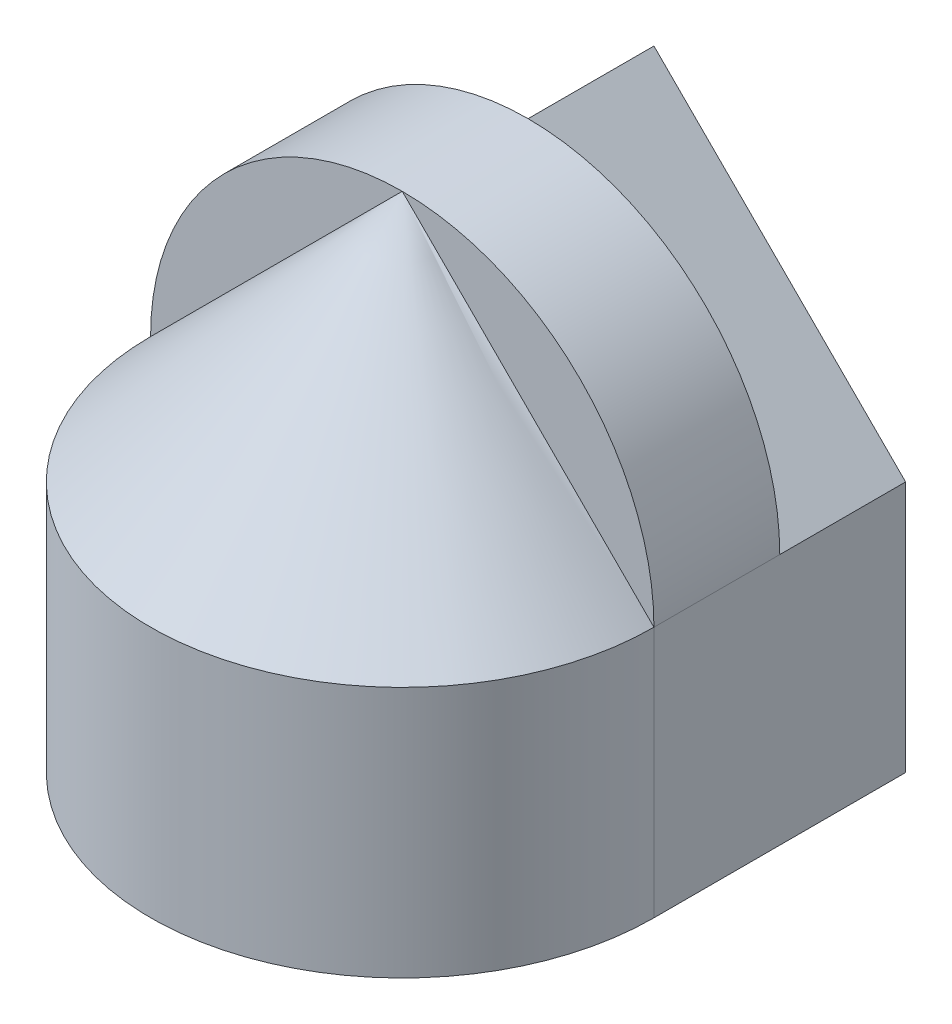
ISO-10303-21;
HEADER;
FILE_DESCRIPTION(('STEP AP214'),'2;1');
FILE_NAME('part.step','',(''),(''),'','','');
FILE_SCHEMA(('AUTOMOTIVE_DESIGN { 1 0 10303 214 1 1 1 1 }'));
ENDSEC;
DATA;
#1=APPLICATION_CONTEXT('core data for automotive mechanical design processes');
#2=APPLICATION_PROTOCOL_DEFINITION('international standard','automotive_design',2000,#1);
#3=PRODUCT_CONTEXT('',#1,'mechanical');
#4=PRODUCT('Part','Part','',(#3));
#5=PRODUCT_RELATED_PRODUCT_CATEGORY('part','',(#4));
#6=PRODUCT_DEFINITION_FORMATION('','',#4);
#7=PRODUCT_DEFINITION_CONTEXT('part definition',#1,'design');
#8=PRODUCT_DEFINITION('design','',#6,#7);
#9=PRODUCT_DEFINITION_SHAPE('','',#8);
#10=(LENGTH_UNIT() NAMED_UNIT(*) SI_UNIT(.MILLI.,.METRE.));
#11=(NAMED_UNIT(*) PLANE_ANGLE_UNIT() SI_UNIT($,.RADIAN.));
#12=(NAMED_UNIT(*) SI_UNIT($,.STERADIAN.) SOLID_ANGLE_UNIT());
#13=UNCERTAINTY_MEASURE_WITH_UNIT(LENGTH_MEASURE(1.E-05),#10,'distance_accuracy_value','');
#14=(GEOMETRIC_REPRESENTATION_CONTEXT(3) GLOBAL_UNCERTAINTY_ASSIGNED_CONTEXT((#13)) GLOBAL_UNIT_ASSIGNED_CONTEXT((#10,
#11,#12)) REPRESENTATION_CONTEXT('',''));
#15=CARTESIAN_POINT('',(0.,0.,0.));
#16=DIRECTION('',(0.,0.,1.));
#17=DIRECTION('',(1.,0.,0.));
#18=AXIS2_PLACEMENT_3D('',#15,#16,#17);
#19=CARTESIAN_POINT('',(40.,20.,20.));
#20=DIRECTION('',(0.,0.,1.));
#21=DIRECTION('',(1.,0.,0.));
#22=AXIS2_PLACEMENT_3D('',#19,#20,#21);
#23=PLANE('',#22);
#24=CARTESIAN_POINT('',(20.,20.,20.));
#25=DIRECTION('',(0.,0.,1.));
#26=DIRECTION('',(1.,0.,0.));
#27=AXIS2_PLACEMENT_3D('',#24,#25,#26);
#28=CIRCLE('',#27,20.);
#29=CARTESIAN_POINT('',(20.,40.,20.));
#30=VERTEX_POINT('',#29);
#31=CARTESIAN_POINT('',(0.,20.,20.));
#32=VERTEX_POINT('',#31);
#33=EDGE_CURVE('E132',#30,#32,#28,.T.);
#34=ORIENTED_EDGE('',*,*,#33,.T.);
#35=DIRECTION('',(-0.707106781186545,-0.70710678118655,0.));
#36=VECTOR('',#35,1.);
#37=CARTESIAN_POINT('',(20.,40.,20.));
#38=LINE('',#37,#36);
#39=EDGE_CURVE('E127',#30,#32,#38,.T.);
#40=ORIENTED_EDGE('',*,*,#39,.F.);
#41=EDGE_LOOP('',(#34,#40));
#42=FACE_BOUND('',#41,.T.);
#43=ADVANCED_FACE('F65',(#42),#23,.T.);
#44=CARTESIAN_POINT('',(40.,19.9999999999999,19.9999999999999));
#45=VERTEX_POINT('',#44);
#46=EDGE_CURVE('E140',#45,#30,#28,.T.);
#47=ORIENTED_EDGE('',*,*,#46,.T.);
#48=DIRECTION('',(0.707106781186545,-0.70710678118655,0.));
#49=VECTOR('',#48,1.);
#50=CARTESIAN_POINT('',(20.,40.,20.));
#51=LINE('',#50,#49);
#52=EDGE_CURVE('E124',#30,#45,#51,.T.);
#53=ORIENTED_EDGE('',*,*,#52,.T.);
#54=EDGE_LOOP('',(#47,#53));
#55=FACE_BOUND('',#54,.T.);
#56=ADVANCED_FACE('F146',(#55),#23,.T.);
#57=CARTESIAN_POINT('',(20.,20.,40.));
#58=DIRECTION('',(0.,0.,-1.));
#59=DIRECTION('',(-1.,0.,0.));
#60=AXIS2_PLACEMENT_3D('',#57,#58,#59);
#61=CYLINDRICAL_SURFACE('',#60,20.);
#62=ORIENTED_EDGE('',*,*,#46,.F.);
#63=DIRECTION('',(0.,0.,-1.));
#64=VECTOR('',#63,1.);
#65=CARTESIAN_POINT('',(40.,20.,40.));
#66=LINE('',#65,#64);
#67=CARTESIAN_POINT('',(40.,20.,10.));
#68=VERTEX_POINT('',#67);
#69=EDGE_CURVE('E181',#45,#68,#66,.T.);
#70=ORIENTED_EDGE('',*,*,#69,.T.);
#71=CARTESIAN_POINT('',(20.,20.,10.));
#72=DIRECTION('',(0.,0.,-1.));
#73=DIRECTION('',(-1.,0.,0.));
#74=AXIS2_PLACEMENT_3D('',#71,#72,#73);
#75=CIRCLE('',#74,20.);
#76=CARTESIAN_POINT('',(20.,40.,10.));
#77=VERTEX_POINT('',#76);
#78=EDGE_CURVE('E160',#77,#68,#75,.T.);
#79=ORIENTED_EDGE('',*,*,#78,.F.);
#80=CARTESIAN_POINT('',(20.,20.,10.));
#81=DIRECTION('',(0.,0.,-1.));
#82=DIRECTION('',(-1.,0.,0.));
#83=AXIS2_PLACEMENT_3D('',#80,#81,#82);
#84=CIRCLE('',#83,20.);
#85=CARTESIAN_POINT('',(0.,20.,10.));
#86=VERTEX_POINT('',#85);
#87=EDGE_CURVE('E147',#86,#77,#84,.T.);
#88=ORIENTED_EDGE('',*,*,#87,.F.);
#89=DIRECTION('',(0.,0.,-1.));
#90=VECTOR('',#89,1.);
#91=CARTESIAN_POINT('',(0.,20.,40.));
#92=LINE('',#91,#90);
#93=EDGE_CURVE('E144',#32,#86,#92,.T.);
#94=ORIENTED_EDGE('',*,*,#93,.F.);
#95=ORIENTED_EDGE('',*,*,#33,.F.);
#96=EDGE_LOOP('',(#62,#70,#79,#88,#94,#95));
#97=FACE_BOUND('',#96,.T.);
#98=ADVANCED_FACE('F67',(#97),#61,.T.);
#99=CARTESIAN_POINT('',(20.,40.,20.));
#100=DIRECTION('',(0.,-1.,0.));
#101=DIRECTION('',(0.,0.,-1.));
#102=AXIS2_PLACEMENT_3D('',#99,#100,#101);
#103=CYLINDRICAL_SURFACE('',#102,20.);
#104=CARTESIAN_POINT('',(20.,20.,20.));
#105=DIRECTION('',(0.,1.,0.));
#106=DIRECTION('',(0.,0.,1.));
#107=AXIS2_PLACEMENT_3D('',#104,#105,#106);
#108=CIRCLE('',#107,20.);
#109=EDGE_CURVE('E12',#45,#32,#108,.F.);
#110=ORIENTED_EDGE('',*,*,#109,.T.);
#111=DIRECTION('',(0.,-1.,0.));
#112=VECTOR('',#111,1.);
#113=CARTESIAN_POINT('',(0.,40.,20.));
#114=LINE('',#113,#112);
#115=CARTESIAN_POINT('',(0.,0.,20.));
#116=VERTEX_POINT('',#115);
#117=EDGE_CURVE('E172',#32,#116,#114,.T.);
#118=ORIENTED_EDGE('',*,*,#117,.T.);
#119=CARTESIAN_POINT('',(20.,0.,20.));
#120=DIRECTION('',(0.,1.,0.));
#121=DIRECTION('',(0.,0.,1.));
#122=AXIS2_PLACEMENT_3D('',#119,#120,#121);
#123=CIRCLE('',#122,20.);
#124=CARTESIAN_POINT('',(40.,0.,20.));
#125=VERTEX_POINT('',#124);
#126=EDGE_CURVE('E168',#125,#116,#123,.F.);
#127=ORIENTED_EDGE('',*,*,#126,.F.);
#128=DIRECTION('',(0.,-1.,0.));
#129=VECTOR('',#128,1.);
#130=CARTESIAN_POINT('',(40.,40.,20.));
#131=LINE('',#130,#129);
#132=EDGE_CURVE('E73',#45,#125,#131,.T.);
#133=ORIENTED_EDGE('',*,*,#132,.F.);
#134=EDGE_LOOP('',(#110,#118,#127,#133));
#135=FACE_BOUND('',#134,.T.);
#136=ADVANCED_FACE('F227',(#135),#103,.T.);
#137=CARTESIAN_POINT('',(0.,0.,40.));
#138=DIRECTION('',(0.,1.,0.));
#139=DIRECTION('',(0.,0.,1.));
#140=AXIS2_PLACEMENT_3D('',#137,#138,#139);
#141=PLANE('',#140);
#142=DIRECTION('',(0.,0.,-1.));
#143=VECTOR('',#142,1.);
#144=CARTESIAN_POINT('',(40.,0.,40.));
#145=LINE('',#144,#143);
#146=CARTESIAN_POINT('',(40.,0.,0.));
#147=VERTEX_POINT('',#146);
#148=EDGE_CURVE('E88',#125,#147,#145,.T.);
#149=ORIENTED_EDGE('',*,*,#148,.F.);
#150=ORIENTED_EDGE('',*,*,#126,.T.);
#151=DIRECTION('',(0.,0.,-1.));
#152=VECTOR('',#151,1.);
#153=CARTESIAN_POINT('',(0.,0.,40.));
#154=LINE('',#153,#152);
#155=CARTESIAN_POINT('',(0.,0.,0.));
#156=VERTEX_POINT('',#155);
#157=EDGE_CURVE('E184',#116,#156,#154,.T.);
#158=ORIENTED_EDGE('',*,*,#157,.T.);
#159=DIRECTION('',(1.,0.,0.));
#160=VECTOR('',#159,1.);
#161=CARTESIAN_POINT('',(0.,0.,0.));
#162=LINE('',#161,#160);
#163=EDGE_CURVE('E177',#156,#147,#162,.T.);
#164=ORIENTED_EDGE('',*,*,#163,.T.);
#165=EDGE_LOOP('',(#149,#150,#158,#164));
#166=FACE_BOUND('',#165,.T.);
#167=ADVANCED_FACE('F190',(#166),#141,.F.);
#168=CARTESIAN_POINT('',(0.,0.,40.));
#169=DIRECTION('',(-1.,0.,0.));
#170=DIRECTION('',(0.,0.,1.));
#171=AXIS2_PLACEMENT_3D('',#168,#169,#170);
#172=PLANE('',#171);
#173=ORIENTED_EDGE('',*,*,#117,.F.);
#174=ORIENTED_EDGE('',*,*,#93,.T.);
#175=DIRECTION('',(0.,0.,-1.));
#176=VECTOR('',#175,1.);
#177=CARTESIAN_POINT('',(0.,20.,10.));
#178=LINE('',#177,#176);
#179=CARTESIAN_POINT('',(0.,20.,0.));
#180=VERTEX_POINT('',#179);
#181=EDGE_CURVE('E152',#86,#180,#178,.T.);
#182=ORIENTED_EDGE('',*,*,#181,.T.);
#183=DIRECTION('',(0.,1.,0.));
#184=VECTOR('',#183,1.);
#185=CARTESIAN_POINT('',(0.,0.,0.));
#186=LINE('',#185,#184);
#187=EDGE_CURVE('E174',#156,#180,#186,.T.);
#188=ORIENTED_EDGE('',*,*,#187,.F.);
#189=ORIENTED_EDGE('',*,*,#157,.F.);
#190=EDGE_LOOP('',(#173,#174,#182,#188,#189));
#191=FACE_BOUND('',#190,.T.);
#192=ADVANCED_FACE('F207',(#191),#172,.T.);
#193=CARTESIAN_POINT('',(40.,0.,40.));
#194=DIRECTION('',(-1.,0.,0.));
#195=DIRECTION('',(0.,0.,1.));
#196=AXIS2_PLACEMENT_3D('',#193,#194,#195);
#197=PLANE('',#196);
#198=ORIENTED_EDGE('',*,*,#69,.F.);
#199=ORIENTED_EDGE('',*,*,#132,.T.);
#200=ORIENTED_EDGE('',*,*,#148,.T.);
#201=DIRECTION('',(0.,1.,0.));
#202=VECTOR('',#201,1.);
#203=CARTESIAN_POINT('',(40.,0.,0.));
#204=LINE('',#203,#202);
#205=CARTESIAN_POINT('',(40.,20.,0.));
#206=VERTEX_POINT('',#205);
#207=EDGE_CURVE('E179',#147,#206,#204,.T.);
#208=ORIENTED_EDGE('',*,*,#207,.T.);
#209=DIRECTION('',(0.,0.,-1.));
#210=VECTOR('',#209,1.);
#211=CARTESIAN_POINT('',(40.,20.,10.));
#212=LINE('',#211,#210);
#213=EDGE_CURVE('E80',#68,#206,#212,.T.);
#214=ORIENTED_EDGE('',*,*,#213,.F.);
#215=EDGE_LOOP('',(#198,#199,#200,#208,#214));
#216=FACE_BOUND('',#215,.T.);
#217=ADVANCED_FACE('F187',(#216),#197,.F.);
#218=CARTESIAN_POINT('',(0.,0.,0.));
#219=DIRECTION('',(0.,0.,1.));
#220=DIRECTION('',(1.,0.,0.));
#221=AXIS2_PLACEMENT_3D('',#218,#219,#220);
#222=PLANE('',#221);
#223=ORIENTED_EDGE('',*,*,#187,.T.);
#224=DIRECTION('',(-0.707106781186548,-0.707106781186548,0.));
#225=VECTOR('',#224,1.);
#226=CARTESIAN_POINT('',(-10.,10.,0.));
#227=LINE('',#226,#225);
#228=CARTESIAN_POINT('',(20.,40.,0.));
#229=VERTEX_POINT('',#228);
#230=EDGE_CURVE('E155',#229,#180,#227,.T.);
#231=ORIENTED_EDGE('',*,*,#230,.F.);
#232=DIRECTION('',(-0.707106781186548,0.707106781186548,0.));
#233=VECTOR('',#232,1.);
#234=CARTESIAN_POINT('',(30.,30.,0.));
#235=LINE('',#234,#233);
#236=EDGE_CURVE('E157',#206,#229,#235,.T.);
#237=ORIENTED_EDGE('',*,*,#236,.F.);
#238=ORIENTED_EDGE('',*,*,#207,.F.);
#239=ORIENTED_EDGE('',*,*,#163,.F.);
#240=EDGE_LOOP('',(#223,#231,#237,#238,#239));
#241=FACE_BOUND('',#240,.T.);
#242=ADVANCED_FACE('F196',(#241),#222,.F.);
#243=CARTESIAN_POINT('',(30.,30.,10.));
#244=DIRECTION('',(-0.707106781186548,-0.707106781186548,0.));
#245=DIRECTION('',(0.707106781186548,-0.707106781186548,0.));
#246=AXIS2_PLACEMENT_3D('',#243,#244,#245);
#247=PLANE('',#246);
#248=ORIENTED_EDGE('',*,*,#236,.T.);
#249=DIRECTION('',(0.,0.,-1.));
#250=VECTOR('',#249,1.);
#251=CARTESIAN_POINT('',(20.,40.,10.));
#252=LINE('',#251,#250);
#253=EDGE_CURVE('E166',#77,#229,#252,.T.);
#254=ORIENTED_EDGE('',*,*,#253,.F.);
#255=DIRECTION('',(-0.707106781186548,0.707106781186548,0.));
#256=VECTOR('',#255,1.);
#257=CARTESIAN_POINT('',(30.,30.,10.));
#258=LINE('',#257,#256);
#259=EDGE_CURVE('E162',#68,#77,#258,.T.);
#260=ORIENTED_EDGE('',*,*,#259,.F.);
#261=ORIENTED_EDGE('',*,*,#213,.T.);
#262=EDGE_LOOP('',(#248,#254,#260,#261));
#263=FACE_BOUND('',#262,.T.);
#264=ADVANCED_FACE('F202',(#263),#247,.F.);
#265=CARTESIAN_POINT('',(0.,0.,10.));
#266=DIRECTION('',(0.,0.,-1.));
#267=DIRECTION('',(-1.,0.,0.));
#268=AXIS2_PLACEMENT_3D('',#265,#266,#267);
#269=PLANE('',#268);
#270=ORIENTED_EDGE('',*,*,#78,.T.);
#271=ORIENTED_EDGE('',*,*,#259,.T.);
#272=EDGE_LOOP('',(#270,#271));
#273=FACE_BOUND('',#272,.T.);
#274=ADVANCED_FACE('F200',(#273),#269,.T.);
#275=CARTESIAN_POINT('',(-10.,10.,10.));
#276=DIRECTION('',(0.707106781186548,-0.707106781186548,0.));
#277=DIRECTION('',(0.707106781186548,0.707106781186548,0.));
#278=AXIS2_PLACEMENT_3D('',#275,#276,#277);
#279=PLANE('',#278);
#280=ORIENTED_EDGE('',*,*,#230,.T.);
#281=ORIENTED_EDGE('',*,*,#181,.F.);
#282=DIRECTION('',(-0.707106781186548,-0.707106781186548,0.));
#283=VECTOR('',#282,1.);
#284=CARTESIAN_POINT('',(-10.,10.,10.));
#285=LINE('',#284,#283);
#286=EDGE_CURVE('E149',#77,#86,#285,.T.);
#287=ORIENTED_EDGE('',*,*,#286,.F.);
#288=ORIENTED_EDGE('',*,*,#253,.T.);
#289=EDGE_LOOP('',(#280,#281,#287,#288));
#290=FACE_BOUND('',#289,.T.);
#291=ADVANCED_FACE('F204',(#290),#279,.F.);
#292=CARTESIAN_POINT('',(0.,0.,10.));
#293=DIRECTION('',(0.,0.,-1.));
#294=DIRECTION('',(-1.,0.,0.));
#295=AXIS2_PLACEMENT_3D('',#292,#293,#294);
#296=PLANE('',#295);
#297=ORIENTED_EDGE('',*,*,#87,.T.);
#298=ORIENTED_EDGE('',*,*,#286,.T.);
#299=EDGE_LOOP('',(#297,#298));
#300=FACE_BOUND('',#299,.T.);
#301=ADVANCED_FACE('F209',(#300),#296,.T.);
#302=CARTESIAN_POINT('',(20.,40.,20.));
#303=DIRECTION('',(0.,-1.,0.));
#304=DIRECTION('',(0.,0.,-1.));
#305=AXIS2_PLACEMENT_3D('',#302,#303,#304);
#306=CONICAL_SURFACE('',#305,0.,0.785398163397445);
#307=ORIENTED_EDGE('',*,*,#52,.F.);
#308=ORIENTED_EDGE('',*,*,#39,.T.);
#309=ORIENTED_EDGE('',*,*,#109,.F.);
#310=EDGE_LOOP('',(#307,#308,#309));
#311=FACE_BOUND('',#310,.T.);
#312=ADVANCED_FACE('F126',(#311),#306,.T.);
#313=CLOSED_SHELL('',(#43,#56,#98,#136,#167,#192,#217,#242,#264,#274,#291,#301,#312));
#314=MANIFOLD_SOLID_BREP('B2',#313);
#315=ADVANCED_BREP_SHAPE_REPRESENTATION('',(#18,#314),#14);
#316=SHAPE_DEFINITION_REPRESENTATION(#9,#315);
ENDSEC;
END-ISO-10303-21;
